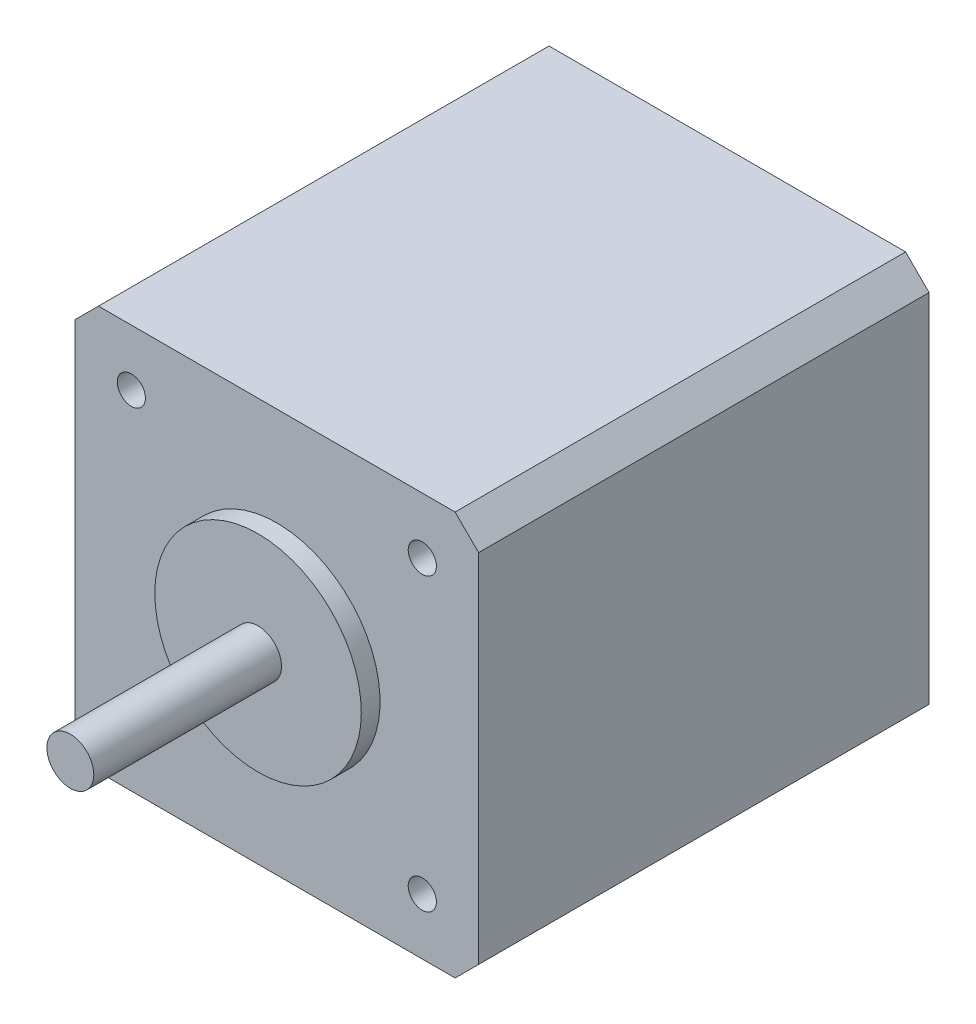
ISO-10303-21;
HEADER;
FILE_DESCRIPTION(('STEP AP214'),'2;1');
FILE_NAME('part.step','',(''),(''),'','','');
FILE_SCHEMA(('AUTOMOTIVE_DESIGN { 1 0 10303 214 1 1 1 1 }'));
ENDSEC;
DATA;
#1=APPLICATION_CONTEXT('core data for automotive mechanical design processes');
#2=APPLICATION_PROTOCOL_DEFINITION('international standard','automotive_design',2000,#1);
#3=PRODUCT_CONTEXT('',#1,'mechanical');
#4=PRODUCT('Part','Part','',(#3));
#5=PRODUCT_RELATED_PRODUCT_CATEGORY('part','',(#4));
#6=PRODUCT_DEFINITION_FORMATION('','',#4);
#7=PRODUCT_DEFINITION_CONTEXT('part definition',#1,'design');
#8=PRODUCT_DEFINITION('design','',#6,#7);
#9=PRODUCT_DEFINITION_SHAPE('','',#8);
#10=(LENGTH_UNIT() NAMED_UNIT(*) SI_UNIT(.MILLI.,.METRE.));
#11=(NAMED_UNIT(*) PLANE_ANGLE_UNIT() SI_UNIT($,.RADIAN.));
#12=(NAMED_UNIT(*) SI_UNIT($,.STERADIAN.) SOLID_ANGLE_UNIT());
#13=UNCERTAINTY_MEASURE_WITH_UNIT(LENGTH_MEASURE(1.E-05),#10,'distance_accuracy_value','');
#14=(GEOMETRIC_REPRESENTATION_CONTEXT(3) GLOBAL_UNCERTAINTY_ASSIGNED_CONTEXT((#13)) GLOBAL_UNIT_ASSIGNED_CONTEXT((#10,
#11,#12)) REPRESENTATION_CONTEXT('',''));
#15=CARTESIAN_POINT('',(0.,0.,0.));
#16=DIRECTION('',(0.,0.,1.));
#17=DIRECTION('',(1.,0.,0.));
#18=AXIS2_PLACEMENT_3D('',#15,#16,#17);
#19=CARTESIAN_POINT('',(0.,0.,50.));
#20=DIRECTION('',(0.,0.,1.));
#21=DIRECTION('',(1.,0.,0.));
#22=AXIS2_PLACEMENT_3D('',#19,#20,#21);
#23=PLANE('',#22);
#24=CARTESIAN_POINT('',(0.,0.,50.));
#25=DIRECTION('',(0.,0.,1.));
#26=DIRECTION('',(1.,0.,0.));
#27=AXIS2_PLACEMENT_3D('',#24,#25,#26);
#28=CIRCLE('',#27,11.);
#29=CARTESIAN_POINT('',(11.,0.,50.));
#30=VERTEX_POINT('',#29);
#31=EDGE_CURVE('E163',#30,#30,#28,.T.);
#32=ORIENTED_EDGE('',*,*,#31,.T.);
#33=EDGE_LOOP('',(#32));
#34=FACE_BOUND('',#33,.T.);
#35=CARTESIAN_POINT('',(0.,0.,50.));
#36=DIRECTION('',(0.,0.,1.));
#37=DIRECTION('',(1.,0.,0.));
#38=AXIS2_PLACEMENT_3D('',#35,#36,#37);
#39=CIRCLE('',#38,2.5);
#40=CARTESIAN_POINT('',(2.5,0.,50.));
#41=VERTEX_POINT('',#40);
#42=EDGE_CURVE('E174',#41,#41,#39,.T.);
#43=ORIENTED_EDGE('',*,*,#42,.F.);
#44=EDGE_LOOP('',(#43));
#45=FACE_BOUND('',#44,.T.);
#46=ADVANCED_FACE('F34',(#34,#45),#23,.T.);
#47=CARTESIAN_POINT('',(21.5,21.5,48.));
#48=DIRECTION('',(0.,0.,-1.));
#49=DIRECTION('',(-1.,0.,0.));
#50=AXIS2_PLACEMENT_3D('',#47,#48,#49);
#51=PLANE('',#50);
#52=CARTESIAN_POINT('',(-15.4999999999995,-15.5,48.));
#53=DIRECTION('',(0.,0.,1.));
#54=DIRECTION('',(1.,0.,0.));
#55=AXIS2_PLACEMENT_3D('',#52,#53,#54);
#56=CIRCLE('',#55,1.50000000000035);
#57=CARTESIAN_POINT('',(-13.9999999999992,-15.5,48.));
#58=VERTEX_POINT('',#57);
#59=EDGE_CURVE('E198',#58,#58,#56,.T.);
#60=ORIENTED_EDGE('',*,*,#59,.F.);
#61=EDGE_LOOP('',(#60));
#62=FACE_BOUND('',#61,.T.);
#63=CARTESIAN_POINT('',(15.5000000000005,-15.4999999999995,48.));
#64=DIRECTION('',(0.,0.,1.));
#65=DIRECTION('',(1.,0.,0.));
#66=AXIS2_PLACEMENT_3D('',#63,#64,#65);
#67=CIRCLE('',#66,1.50000000000035);
#68=CARTESIAN_POINT('',(17.0000000000008,-15.4999999999995,48.));
#69=VERTEX_POINT('',#68);
#70=EDGE_CURVE('E192',#69,#69,#67,.T.);
#71=ORIENTED_EDGE('',*,*,#70,.F.);
#72=EDGE_LOOP('',(#71));
#73=FACE_BOUND('',#72,.T.);
#74=CARTESIAN_POINT('',(15.5,15.5000000000005,48.));
#75=DIRECTION('',(0.,0.,1.));
#76=DIRECTION('',(1.,0.,0.));
#77=AXIS2_PLACEMENT_3D('',#74,#75,#76);
#78=CIRCLE('',#77,1.50000000000035);
#79=CARTESIAN_POINT('',(17.0000000000003,15.5000000000005,48.));
#80=VERTEX_POINT('',#79);
#81=EDGE_CURVE('E186',#80,#80,#78,.T.);
#82=ORIENTED_EDGE('',*,*,#81,.F.);
#83=EDGE_LOOP('',(#82));
#84=FACE_BOUND('',#83,.T.);
#85=CARTESIAN_POINT('',(-15.5,15.5,48.));
#86=DIRECTION('',(0.,0.,1.));
#87=DIRECTION('',(1.,0.,0.));
#88=AXIS2_PLACEMENT_3D('',#85,#86,#87);
#89=CIRCLE('',#88,1.50000000000035);
#90=CARTESIAN_POINT('',(-13.9999999999996,15.5,48.));
#91=VERTEX_POINT('',#90);
#92=EDGE_CURVE('E180',#91,#91,#89,.T.);
#93=ORIENTED_EDGE('',*,*,#92,.F.);
#94=EDGE_LOOP('',(#93));
#95=FACE_BOUND('',#94,.T.);
#96=DIRECTION('',(0.,-1.,0.));
#97=VECTOR('',#96,1.);
#98=CARTESIAN_POINT('',(-21.5,-21.5,48.));
#99=LINE('',#98,#97);
#100=CARTESIAN_POINT('',(-21.5,19.,48.));
#101=VERTEX_POINT('',#100);
#102=CARTESIAN_POINT('',(-21.5,-19.,48.));
#103=VERTEX_POINT('',#102);
#104=EDGE_CURVE('E167',#101,#103,#99,.T.);
#105=ORIENTED_EDGE('',*,*,#104,.T.);
#106=DIRECTION('',(-0.707106781186545,0.70710678118655,0.));
#107=VECTOR('',#106,1.);
#108=CARTESIAN_POINT('',(-19.,-21.5,48.));
#109=LINE('',#108,#107);
#110=CARTESIAN_POINT('',(-19.,-21.5,48.));
#111=VERTEX_POINT('',#110);
#112=EDGE_CURVE('E148',#103,#111,#109,.F.);
#113=ORIENTED_EDGE('',*,*,#112,.T.);
#114=DIRECTION('',(1.,0.,0.));
#115=VECTOR('',#114,1.);
#116=CARTESIAN_POINT('',(-21.5,-21.5,48.));
#117=LINE('',#116,#115);
#118=CARTESIAN_POINT('',(19.,-21.5,48.));
#119=VERTEX_POINT('',#118);
#120=EDGE_CURVE('E120',#111,#119,#117,.T.);
#121=ORIENTED_EDGE('',*,*,#120,.T.);
#122=DIRECTION('',(-0.70710678118655,-0.707106781186545,0.));
#123=VECTOR('',#122,1.);
#124=CARTESIAN_POINT('',(21.5,-19.,48.));
#125=LINE('',#124,#123);
#126=CARTESIAN_POINT('',(21.5,-19.,48.));
#127=VERTEX_POINT('',#126);
#128=EDGE_CURVE('E146',#119,#127,#125,.F.);
#129=ORIENTED_EDGE('',*,*,#128,.T.);
#130=DIRECTION('',(0.,1.,0.));
#131=VECTOR('',#130,1.);
#132=CARTESIAN_POINT('',(21.5,-21.5,48.));
#133=LINE('',#132,#131);
#134=CARTESIAN_POINT('',(21.5,19.,48.));
#135=VERTEX_POINT('',#134);
#136=EDGE_CURVE('E126',#127,#135,#133,.T.);
#137=ORIENTED_EDGE('',*,*,#136,.T.);
#138=DIRECTION('',(0.707106781186545,-0.70710678118655,0.));
#139=VECTOR('',#138,1.);
#140=CARTESIAN_POINT('',(19.,21.5,48.));
#141=LINE('',#140,#139);
#142=CARTESIAN_POINT('',(19.,21.5,48.));
#143=VERTEX_POINT('',#142);
#144=EDGE_CURVE('E55',#135,#143,#141,.F.);
#145=ORIENTED_EDGE('',*,*,#144,.T.);
#146=DIRECTION('',(-1.,0.,0.));
#147=VECTOR('',#146,1.);
#148=CARTESIAN_POINT('',(-21.5,21.5,48.));
#149=LINE('',#148,#147);
#150=CARTESIAN_POINT('',(-19.,21.5,48.));
#151=VERTEX_POINT('',#150);
#152=EDGE_CURVE('E129',#143,#151,#149,.T.);
#153=ORIENTED_EDGE('',*,*,#152,.T.);
#154=DIRECTION('',(0.70710678118655,0.707106781186545,0.));
#155=VECTOR('',#154,1.);
#156=CARTESIAN_POINT('',(-21.5,19.,48.));
#157=LINE('',#156,#155);
#158=EDGE_CURVE('E144',#151,#101,#157,.F.);
#159=ORIENTED_EDGE('',*,*,#158,.T.);
#160=EDGE_LOOP('',(#105,#113,#121,#129,#137,#145,#153,#159));
#161=FACE_BOUND('',#160,.T.);
#162=CARTESIAN_POINT('',(0.,0.,48.));
#163=DIRECTION('',(0.,0.,-1.));
#164=DIRECTION('',(-1.,0.,0.));
#165=AXIS2_PLACEMENT_3D('',#162,#163,#164);
#166=CIRCLE('',#165,11.);
#167=CARTESIAN_POINT('',(-11.,0.,48.));
#168=VERTEX_POINT('',#167);
#169=EDGE_CURVE('E11',#168,#168,#166,.F.);
#170=ORIENTED_EDGE('',*,*,#169,.F.);
#171=EDGE_LOOP('',(#170));
#172=FACE_BOUND('',#171,.T.);
#173=ADVANCED_FACE('F213',(#62,#73,#84,#95,#161,#172),#51,.F.);
#174=CARTESIAN_POINT('',(21.5,-21.5,48.));
#175=DIRECTION('',(-1.,0.,0.));
#176=DIRECTION('',(0.,0.,1.));
#177=AXIS2_PLACEMENT_3D('',#174,#175,#176);
#178=PLANE('',#177);
#179=ORIENTED_EDGE('',*,*,#136,.F.);
#180=DIRECTION('',(0.,0.,-1.));
#181=VECTOR('',#180,1.);
#182=CARTESIAN_POINT('',(21.5,-19.,48.));
#183=LINE('',#182,#181);
#184=CARTESIAN_POINT('',(21.5,-19.,0.));
#185=VERTEX_POINT('',#184);
#186=EDGE_CURVE('E152',#127,#185,#183,.T.);
#187=ORIENTED_EDGE('',*,*,#186,.T.);
#188=DIRECTION('',(0.,1.,0.));
#189=VECTOR('',#188,1.);
#190=CARTESIAN_POINT('',(21.5,-21.5,0.));
#191=LINE('',#190,#189);
#192=CARTESIAN_POINT('',(21.5,19.,0.));
#193=VERTEX_POINT('',#192);
#194=EDGE_CURVE('E162',#185,#193,#191,.T.);
#195=ORIENTED_EDGE('',*,*,#194,.T.);
#196=DIRECTION('',(0.,0.,1.));
#197=VECTOR('',#196,1.);
#198=CARTESIAN_POINT('',(21.5,19.,48.));
#199=LINE('',#198,#197);
#200=EDGE_CURVE('E150',#193,#135,#199,.T.);
#201=ORIENTED_EDGE('',*,*,#200,.T.);
#202=EDGE_LOOP('',(#179,#187,#195,#201));
#203=FACE_BOUND('',#202,.T.);
#204=ADVANCED_FACE('F216',(#203),#178,.F.);
#205=CARTESIAN_POINT('',(-21.5,21.5,48.));
#206=DIRECTION('',(0.,-1.,0.));
#207=DIRECTION('',(0.,0.,-1.));
#208=AXIS2_PLACEMENT_3D('',#205,#206,#207);
#209=PLANE('',#208);
#210=DIRECTION('',(-1.,0.,0.));
#211=VECTOR('',#210,1.);
#212=CARTESIAN_POINT('',(-21.5,21.5,0.));
#213=LINE('',#212,#211);
#214=CARTESIAN_POINT('',(19.,21.5,0.));
#215=VERTEX_POINT('',#214);
#216=CARTESIAN_POINT('',(-19.,21.5,0.));
#217=VERTEX_POINT('',#216);
#218=EDGE_CURVE('E131',#215,#217,#213,.T.);
#219=ORIENTED_EDGE('',*,*,#218,.T.);
#220=DIRECTION('',(0.,0.,1.));
#221=VECTOR('',#220,1.);
#222=CARTESIAN_POINT('',(-19.,21.5,48.));
#223=LINE('',#222,#221);
#224=EDGE_CURVE('E42',#217,#151,#223,.T.);
#225=ORIENTED_EDGE('',*,*,#224,.T.);
#226=ORIENTED_EDGE('',*,*,#152,.F.);
#227=DIRECTION('',(0.,0.,-1.));
#228=VECTOR('',#227,1.);
#229=CARTESIAN_POINT('',(19.,21.5,48.));
#230=LINE('',#229,#228);
#231=EDGE_CURVE('E155',#143,#215,#230,.T.);
#232=ORIENTED_EDGE('',*,*,#231,.T.);
#233=EDGE_LOOP('',(#219,#225,#226,#232));
#234=FACE_BOUND('',#233,.T.);
#235=ADVANCED_FACE('F159',(#234),#209,.F.);
#236=CARTESIAN_POINT('',(-21.5,-21.5,48.));
#237=DIRECTION('',(1.,0.,0.));
#238=DIRECTION('',(0.,0.,-1.));
#239=AXIS2_PLACEMENT_3D('',#236,#237,#238);
#240=PLANE('',#239);
#241=DIRECTION('',(0.,-1.,0.));
#242=VECTOR('',#241,1.);
#243=CARTESIAN_POINT('',(-21.5,-21.5,0.));
#244=LINE('',#243,#242);
#245=CARTESIAN_POINT('',(-21.5,19.,0.));
#246=VERTEX_POINT('',#245);
#247=CARTESIAN_POINT('',(-21.5,-19.,0.));
#248=VERTEX_POINT('',#247);
#249=EDGE_CURVE('E127',#246,#248,#244,.T.);
#250=ORIENTED_EDGE('',*,*,#249,.T.);
#251=DIRECTION('',(0.,0.,1.));
#252=VECTOR('',#251,1.);
#253=CARTESIAN_POINT('',(-21.5,-19.,48.));
#254=LINE('',#253,#252);
#255=EDGE_CURVE('E105',#248,#103,#254,.T.);
#256=ORIENTED_EDGE('',*,*,#255,.T.);
#257=ORIENTED_EDGE('',*,*,#104,.F.);
#258=DIRECTION('',(0.,0.,-1.));
#259=VECTOR('',#258,1.);
#260=CARTESIAN_POINT('',(-21.5,19.,48.));
#261=LINE('',#260,#259);
#262=EDGE_CURVE('E110',#101,#246,#261,.T.);
#263=ORIENTED_EDGE('',*,*,#262,.T.);
#264=EDGE_LOOP('',(#250,#256,#257,#263));
#265=FACE_BOUND('',#264,.T.);
#266=ADVANCED_FACE('F413',(#265),#240,.F.);
#267=CARTESIAN_POINT('',(-21.5,-21.5,48.));
#268=DIRECTION('',(0.,1.,0.));
#269=DIRECTION('',(0.,0.,1.));
#270=AXIS2_PLACEMENT_3D('',#267,#268,#269);
#271=PLANE('',#270);
#272=ORIENTED_EDGE('',*,*,#120,.F.);
#273=DIRECTION('',(0.,0.,-1.));
#274=VECTOR('',#273,1.);
#275=CARTESIAN_POINT('',(-19.,-21.5,48.));
#276=LINE('',#275,#274);
#277=CARTESIAN_POINT('',(-19.,-21.5,0.));
#278=VERTEX_POINT('',#277);
#279=EDGE_CURVE('E104',#111,#278,#276,.T.);
#280=ORIENTED_EDGE('',*,*,#279,.T.);
#281=DIRECTION('',(1.,0.,0.));
#282=VECTOR('',#281,1.);
#283=CARTESIAN_POINT('',(-21.5,-21.5,0.));
#284=LINE('',#283,#282);
#285=CARTESIAN_POINT('',(19.,-21.5,0.));
#286=VERTEX_POINT('',#285);
#287=EDGE_CURVE('E117',#278,#286,#284,.T.);
#288=ORIENTED_EDGE('',*,*,#287,.T.);
#289=DIRECTION('',(0.,0.,1.));
#290=VECTOR('',#289,1.);
#291=CARTESIAN_POINT('',(19.,-21.5,48.));
#292=LINE('',#291,#290);
#293=EDGE_CURVE('E122',#286,#119,#292,.T.);
#294=ORIENTED_EDGE('',*,*,#293,.T.);
#295=EDGE_LOOP('',(#272,#280,#288,#294));
#296=FACE_BOUND('',#295,.T.);
#297=ADVANCED_FACE('F116',(#296),#271,.F.);
#298=CARTESIAN_POINT('',(21.5,21.5,0.));
#299=DIRECTION('',(0.,0.,-1.));
#300=DIRECTION('',(-1.,0.,0.));
#301=AXIS2_PLACEMENT_3D('',#298,#299,#300);
#302=PLANE('',#301);
#303=ORIENTED_EDGE('',*,*,#287,.F.);
#304=DIRECTION('',(0.707106781186545,-0.70710678118655,0.));
#305=VECTOR('',#304,1.);
#306=CARTESIAN_POINT('',(-20.2500000000002,-20.2499999999998,0.));
#307=LINE('',#306,#305);
#308=EDGE_CURVE('E100',#278,#248,#307,.F.);
#309=ORIENTED_EDGE('',*,*,#308,.T.);
#310=ORIENTED_EDGE('',*,*,#249,.F.);
#311=DIRECTION('',(-0.70710678118655,-0.707106781186545,0.));
#312=VECTOR('',#311,1.);
#313=CARTESIAN_POINT('',(1.25000000000016,41.75,0.));
#314=LINE('',#313,#312);
#315=EDGE_CURVE('E137',#246,#217,#314,.F.);
#316=ORIENTED_EDGE('',*,*,#315,.T.);
#317=ORIENTED_EDGE('',*,*,#218,.F.);
#318=DIRECTION('',(-0.707106781186545,0.70710678118655,0.));
#319=VECTOR('',#318,1.);
#320=CARTESIAN_POINT('',(20.25,20.25,0.));
#321=LINE('',#320,#319);
#322=EDGE_CURVE('E121',#215,#193,#321,.F.);
#323=ORIENTED_EDGE('',*,*,#322,.T.);
#324=ORIENTED_EDGE('',*,*,#194,.F.);
#325=DIRECTION('',(0.70710678118655,0.707106781186545,0.));
#326=VECTOR('',#325,1.);
#327=CARTESIAN_POINT('',(41.75,1.24999999999983,0.));
#328=LINE('',#327,#326);
#329=EDGE_CURVE('E111',#185,#286,#328,.F.);
#330=ORIENTED_EDGE('',*,*,#329,.T.);
#331=EDGE_LOOP('',(#303,#309,#310,#316,#317,#323,#324,#330));
#332=FACE_BOUND('',#331,.T.);
#333=ADVANCED_FACE('F124',(#332),#302,.T.);
#334=CARTESIAN_POINT('',(-19.,-21.5,48.));
#335=DIRECTION('',(0.70710678118655,0.707106781186544,0.));
#336=DIRECTION('',(-0.707106781186545,0.70710678118655,0.));
#337=AXIS2_PLACEMENT_3D('',#334,#335,#336);
#338=PLANE('',#337);
#339=ORIENTED_EDGE('',*,*,#112,.F.);
#340=ORIENTED_EDGE('',*,*,#255,.F.);
#341=ORIENTED_EDGE('',*,*,#308,.F.);
#342=ORIENTED_EDGE('',*,*,#279,.F.);
#343=EDGE_LOOP('',(#339,#340,#341,#342));
#344=FACE_BOUND('',#343,.T.);
#345=ADVANCED_FACE('F103',(#344),#338,.F.);
#346=CARTESIAN_POINT('',(21.5,-19.,48.));
#347=DIRECTION('',(-0.707106781186544,0.70710678118655,0.));
#348=DIRECTION('',(-0.70710678118655,-0.707106781186545,0.));
#349=AXIS2_PLACEMENT_3D('',#346,#347,#348);
#350=PLANE('',#349);
#351=ORIENTED_EDGE('',*,*,#128,.F.);
#352=ORIENTED_EDGE('',*,*,#293,.F.);
#353=ORIENTED_EDGE('',*,*,#329,.F.);
#354=ORIENTED_EDGE('',*,*,#186,.F.);
#355=EDGE_LOOP('',(#351,#352,#353,#354));
#356=FACE_BOUND('',#355,.T.);
#357=ADVANCED_FACE('F373',(#356),#350,.F.);
#358=CARTESIAN_POINT('',(-21.5,19.,48.));
#359=DIRECTION('',(0.707106781186545,-0.70710678118655,0.));
#360=DIRECTION('',(0.70710678118655,0.707106781186545,0.));
#361=AXIS2_PLACEMENT_3D('',#358,#359,#360);
#362=PLANE('',#361);
#363=ORIENTED_EDGE('',*,*,#158,.F.);
#364=ORIENTED_EDGE('',*,*,#224,.F.);
#365=ORIENTED_EDGE('',*,*,#315,.F.);
#366=ORIENTED_EDGE('',*,*,#262,.F.);
#367=EDGE_LOOP('',(#363,#364,#365,#366));
#368=FACE_BOUND('',#367,.T.);
#369=ADVANCED_FACE('F239',(#368),#362,.F.);
#370=CARTESIAN_POINT('',(19.,21.5,48.));
#371=DIRECTION('',(-0.70710678118655,-0.707106781186545,0.));
#372=DIRECTION('',(0.707106781186545,-0.70710678118655,0.));
#373=AXIS2_PLACEMENT_3D('',#370,#371,#372);
#374=PLANE('',#373);
#375=ORIENTED_EDGE('',*,*,#144,.F.);
#376=ORIENTED_EDGE('',*,*,#200,.F.);
#377=ORIENTED_EDGE('',*,*,#322,.F.);
#378=ORIENTED_EDGE('',*,*,#231,.F.);
#379=EDGE_LOOP('',(#375,#376,#377,#378));
#380=FACE_BOUND('',#379,.T.);
#381=ADVANCED_FACE('F36',(#380),#374,.F.);
#382=CARTESIAN_POINT('',(0.,0.,50.));
#383=DIRECTION('',(0.,0.,-1.));
#384=DIRECTION('',(-1.,0.,0.));
#385=AXIS2_PLACEMENT_3D('',#382,#383,#384);
#386=CYLINDRICAL_SURFACE('',#385,11.);
#387=ORIENTED_EDGE('',*,*,#31,.F.);
#388=EDGE_LOOP('',(#387));
#389=FACE_BOUND('',#388,.T.);
#390=ORIENTED_EDGE('',*,*,#169,.T.);
#391=EDGE_LOOP('',(#390));
#392=FACE_BOUND('',#391,.T.);
#393=ADVANCED_FACE('F227',(#389,#392),#386,.T.);
#394=CARTESIAN_POINT('',(0.,0.,70.));
#395=DIRECTION('',(0.,0.,-1.));
#396=DIRECTION('',(-1.,0.,0.));
#397=AXIS2_PLACEMENT_3D('',#394,#395,#396);
#398=CYLINDRICAL_SURFACE('',#397,2.5);
#399=CARTESIAN_POINT('',(0.,0.,70.));
#400=DIRECTION('',(0.,0.,1.));
#401=DIRECTION('',(1.,0.,0.));
#402=AXIS2_PLACEMENT_3D('',#399,#400,#401);
#403=CIRCLE('',#402,2.5);
#404=CARTESIAN_POINT('',(2.5,0.,70.));
#405=VERTEX_POINT('',#404);
#406=EDGE_CURVE('E173',#405,#405,#403,.T.);
#407=ORIENTED_EDGE('',*,*,#406,.F.);
#408=EDGE_LOOP('',(#407));
#409=FACE_BOUND('',#408,.T.);
#410=ORIENTED_EDGE('',*,*,#42,.T.);
#411=EDGE_LOOP('',(#410));
#412=FACE_BOUND('',#411,.T.);
#413=ADVANCED_FACE('F229',(#409,#412),#398,.T.);
#414=CARTESIAN_POINT('',(0.,0.,70.));
#415=DIRECTION('',(0.,0.,1.));
#416=DIRECTION('',(1.,0.,0.));
#417=AXIS2_PLACEMENT_3D('',#414,#415,#416);
#418=PLANE('',#417);
#419=ORIENTED_EDGE('',*,*,#406,.T.);
#420=EDGE_LOOP('',(#419));
#421=FACE_BOUND('',#420,.T.);
#422=ADVANCED_FACE('F236',(#421),#418,.T.);
#423=CARTESIAN_POINT('',(-15.5,15.5,38.));
#424=DIRECTION('',(0.,0.,1.));
#425=DIRECTION('',(1.,0.,0.));
#426=AXIS2_PLACEMENT_3D('',#423,#424,#425);
#427=CYLINDRICAL_SURFACE('',#426,1.50000000000035);
#428=CARTESIAN_POINT('',(-15.5,15.5,38.));
#429=DIRECTION('',(0.,0.,1.));
#430=DIRECTION('',(1.,0.,0.));
#431=AXIS2_PLACEMENT_3D('',#428,#429,#430);
#432=CIRCLE('',#431,1.50000000000035);
#433=CARTESIAN_POINT('',(-13.9999999999996,15.5,38.));
#434=VERTEX_POINT('',#433);
#435=EDGE_CURVE('E177',#434,#434,#432,.T.);
#436=ORIENTED_EDGE('',*,*,#435,.F.);
#437=EDGE_LOOP('',(#436));
#438=FACE_BOUND('',#437,.T.);
#439=ORIENTED_EDGE('',*,*,#92,.T.);
#440=EDGE_LOOP('',(#439));
#441=FACE_BOUND('',#440,.T.);
#442=ADVANCED_FACE('F250',(#438,#441),#427,.F.);
#443=CARTESIAN_POINT('',(-15.5,15.5,38.));
#444=DIRECTION('',(0.,0.,1.));
#445=DIRECTION('',(1.,0.,0.));
#446=AXIS2_PLACEMENT_3D('',#443,#444,#445);
#447=PLANE('',#446);
#448=ORIENTED_EDGE('',*,*,#435,.T.);
#449=EDGE_LOOP('',(#448));
#450=FACE_BOUND('',#449,.T.);
#451=ADVANCED_FACE('F254',(#450),#447,.T.);
#452=CARTESIAN_POINT('',(15.5,15.5000000000005,38.));
#453=DIRECTION('',(0.,0.,1.));
#454=DIRECTION('',(1.,0.,0.));
#455=AXIS2_PLACEMENT_3D('',#452,#453,#454);
#456=CYLINDRICAL_SURFACE('',#455,1.50000000000035);
#457=CARTESIAN_POINT('',(15.5,15.5000000000005,38.));
#458=DIRECTION('',(0.,0.,1.));
#459=DIRECTION('',(1.,0.,0.));
#460=AXIS2_PLACEMENT_3D('',#457,#458,#459);
#461=CIRCLE('',#460,1.50000000000035);
#462=CARTESIAN_POINT('',(17.0000000000003,15.5000000000005,38.));
#463=VERTEX_POINT('',#462);
#464=EDGE_CURVE('E183',#463,#463,#461,.T.);
#465=ORIENTED_EDGE('',*,*,#464,.F.);
#466=EDGE_LOOP('',(#465));
#467=FACE_BOUND('',#466,.T.);
#468=ORIENTED_EDGE('',*,*,#81,.T.);
#469=EDGE_LOOP('',(#468));
#470=FACE_BOUND('',#469,.T.);
#471=ADVANCED_FACE('F258',(#467,#470),#456,.F.);
#472=CARTESIAN_POINT('',(15.5,15.5000000000005,38.));
#473=DIRECTION('',(0.,0.,1.));
#474=DIRECTION('',(1.,0.,0.));
#475=AXIS2_PLACEMENT_3D('',#472,#473,#474);
#476=PLANE('',#475);
#477=ORIENTED_EDGE('',*,*,#464,.T.);
#478=EDGE_LOOP('',(#477));
#479=FACE_BOUND('',#478,.T.);
#480=ADVANCED_FACE('F262',(#479),#476,.T.);
#481=CARTESIAN_POINT('',(15.5000000000005,-15.4999999999995,38.));
#482=DIRECTION('',(0.,0.,1.));
#483=DIRECTION('',(1.,0.,0.));
#484=AXIS2_PLACEMENT_3D('',#481,#482,#483);
#485=CYLINDRICAL_SURFACE('',#484,1.50000000000035);
#486=CARTESIAN_POINT('',(15.5000000000005,-15.4999999999995,38.));
#487=DIRECTION('',(0.,0.,1.));
#488=DIRECTION('',(1.,0.,0.));
#489=AXIS2_PLACEMENT_3D('',#486,#487,#488);
#490=CIRCLE('',#489,1.50000000000035);
#491=CARTESIAN_POINT('',(17.0000000000008,-15.4999999999995,38.));
#492=VERTEX_POINT('',#491);
#493=EDGE_CURVE('E189',#492,#492,#490,.T.);
#494=ORIENTED_EDGE('',*,*,#493,.F.);
#495=EDGE_LOOP('',(#494));
#496=FACE_BOUND('',#495,.T.);
#497=ORIENTED_EDGE('',*,*,#70,.T.);
#498=EDGE_LOOP('',(#497));
#499=FACE_BOUND('',#498,.T.);
#500=ADVANCED_FACE('F266',(#496,#499),#485,.F.);
#501=CARTESIAN_POINT('',(15.5000000000005,-15.4999999999995,38.));
#502=DIRECTION('',(0.,0.,1.));
#503=DIRECTION('',(1.,0.,0.));
#504=AXIS2_PLACEMENT_3D('',#501,#502,#503);
#505=PLANE('',#504);
#506=ORIENTED_EDGE('',*,*,#493,.T.);
#507=EDGE_LOOP('',(#506));
#508=FACE_BOUND('',#507,.T.);
#509=ADVANCED_FACE('F209',(#508),#505,.T.);
#510=CARTESIAN_POINT('',(-15.4999999999995,-15.5,38.));
#511=DIRECTION('',(0.,0.,1.));
#512=DIRECTION('',(1.,0.,0.));
#513=AXIS2_PLACEMENT_3D('',#510,#511,#512);
#514=CYLINDRICAL_SURFACE('',#513,1.50000000000035);
#515=CARTESIAN_POINT('',(-15.4999999999995,-15.5,38.));
#516=DIRECTION('',(0.,0.,1.));
#517=DIRECTION('',(1.,0.,0.));
#518=AXIS2_PLACEMENT_3D('',#515,#516,#517);
#519=CIRCLE('',#518,1.50000000000035);
#520=CARTESIAN_POINT('',(-13.9999999999992,-15.5,38.));
#521=VERTEX_POINT('',#520);
#522=EDGE_CURVE('E195',#521,#521,#519,.T.);
#523=ORIENTED_EDGE('',*,*,#522,.F.);
#524=EDGE_LOOP('',(#523));
#525=FACE_BOUND('',#524,.T.);
#526=ORIENTED_EDGE('',*,*,#59,.T.);
#527=EDGE_LOOP('',(#526));
#528=FACE_BOUND('',#527,.T.);
#529=ADVANCED_FACE('F206',(#525,#528),#514,.F.);
#530=CARTESIAN_POINT('',(-15.4999999999995,-15.5,38.));
#531=DIRECTION('',(0.,0.,1.));
#532=DIRECTION('',(1.,0.,0.));
#533=AXIS2_PLACEMENT_3D('',#530,#531,#532);
#534=PLANE('',#533);
#535=ORIENTED_EDGE('',*,*,#522,.T.);
#536=EDGE_LOOP('',(#535));
#537=FACE_BOUND('',#536,.T.);
#538=ADVANCED_FACE('F204',(#537),#534,.T.);
#539=CLOSED_SHELL('',(#46,#173,#204,#235,#266,#297,#333,#345,#357,#369,#381,#393,#413,#422,#442,
#451,#471,#480,#500,#509,#529,#538));
#540=MANIFOLD_SOLID_BREP('B2',#539);
#541=ADVANCED_BREP_SHAPE_REPRESENTATION('',(#18,#540),#14);
#542=SHAPE_DEFINITION_REPRESENTATION(#9,#541);
ENDSEC;
END-ISO-10303-21;
